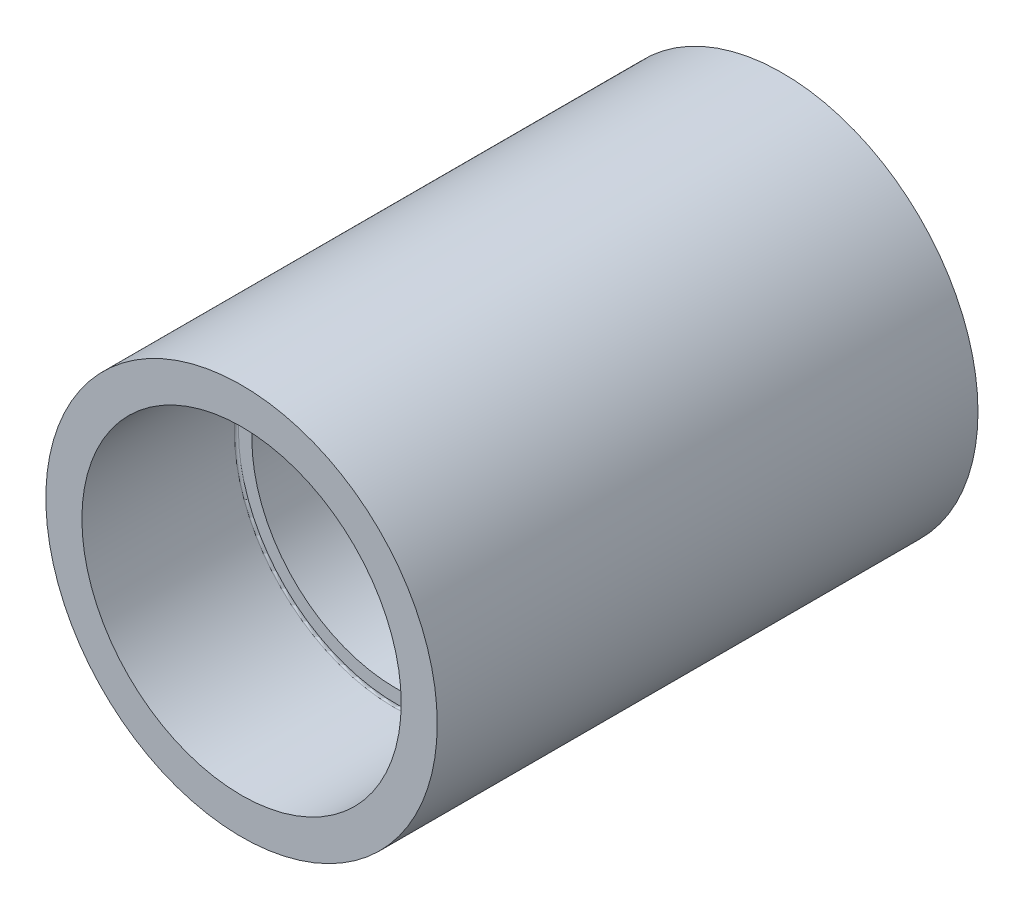
ISO-10303-21;
HEADER;
FILE_DESCRIPTION(('STEP AP214'),'2;1');
FILE_NAME('part.step','',(''),(''),'','','');
FILE_SCHEMA(('AUTOMOTIVE_DESIGN { 1 0 10303 214 1 1 1 1 }'));
ENDSEC;
DATA;
#1=APPLICATION_CONTEXT('core data for automotive mechanical design processes');
#2=APPLICATION_PROTOCOL_DEFINITION('international standard','automotive_design',2000,#1);
#3=PRODUCT_CONTEXT('',#1,'mechanical');
#4=PRODUCT('Part','Part','',(#3));
#5=PRODUCT_RELATED_PRODUCT_CATEGORY('part','',(#4));
#6=PRODUCT_DEFINITION_FORMATION('','',#4);
#7=PRODUCT_DEFINITION_CONTEXT('part definition',#1,'design');
#8=PRODUCT_DEFINITION('design','',#6,#7);
#9=PRODUCT_DEFINITION_SHAPE('','',#8);
#10=(LENGTH_UNIT() NAMED_UNIT(*) SI_UNIT(.MILLI.,.METRE.));
#11=(NAMED_UNIT(*) PLANE_ANGLE_UNIT() SI_UNIT($,.RADIAN.));
#12=(NAMED_UNIT(*) SI_UNIT($,.STERADIAN.) SOLID_ANGLE_UNIT());
#13=UNCERTAINTY_MEASURE_WITH_UNIT(LENGTH_MEASURE(1.E-05),#10,'distance_accuracy_value','');
#14=(GEOMETRIC_REPRESENTATION_CONTEXT(3) GLOBAL_UNCERTAINTY_ASSIGNED_CONTEXT((#13)) GLOBAL_UNIT_ASSIGNED_CONTEXT((#10,
#11,#12)) REPRESENTATION_CONTEXT('',''));
#15=CARTESIAN_POINT('',(0.,0.,0.));
#16=DIRECTION('',(0.,0.,1.));
#17=DIRECTION('',(1.,0.,0.));
#18=AXIS2_PLACEMENT_3D('',#15,#16,#17);
#19=CARTESIAN_POINT('',(0.,31.,52.5));
#20=DIRECTION('',(0.,0.,-1.));
#21=DIRECTION('',(-1.,0.,0.));
#22=AXIS2_PLACEMENT_3D('',#19,#20,#21);
#23=PLANE('',#22);
#24=CARTESIAN_POINT('',(0.,0.,52.5));
#25=DIRECTION('',(0.,0.,1.));
#26=DIRECTION('',(1.,0.,0.));
#27=AXIS2_PLACEMENT_3D('',#24,#25,#26);
#28=CIRCLE('',#27,31.);
#29=CARTESIAN_POINT('',(31.,0.,52.5));
#30=VERTEX_POINT('',#29);
#31=EDGE_CURVE('E67',#30,#30,#28,.T.);
#32=ORIENTED_EDGE('',*,*,#31,.F.);
#33=EDGE_LOOP('',(#32));
#34=FACE_BOUND('',#33,.T.);
#35=CARTESIAN_POINT('',(0.,0.,52.5));
#36=DIRECTION('',(0.,0.,1.));
#37=DIRECTION('',(1.,0.,0.));
#38=AXIS2_PLACEMENT_3D('',#35,#36,#37);
#39=CIRCLE('',#38,38.);
#40=CARTESIAN_POINT('',(38.,0.,52.5));
#41=VERTEX_POINT('',#40);
#42=EDGE_CURVE('E52',#41,#41,#39,.T.);
#43=ORIENTED_EDGE('',*,*,#42,.T.);
#44=EDGE_LOOP('',(#43));
#45=FACE_BOUND('',#44,.T.);
#46=ADVANCED_FACE('F32',(#34,#45),#23,.F.);
#47=CARTESIAN_POINT('',(0.,0.,52.5));
#48=DIRECTION('',(0.,0.,1.));
#49=DIRECTION('',(1.,0.,0.));
#50=AXIS2_PLACEMENT_3D('',#47,#48,#49);
#51=CYLINDRICAL_SURFACE('',#50,38.);
#52=ORIENTED_EDGE('',*,*,#42,.F.);
#53=EDGE_LOOP('',(#52));
#54=FACE_BOUND('',#53,.T.);
#55=CARTESIAN_POINT('',(0.,0.,-52.5));
#56=DIRECTION('',(0.,0.,1.));
#57=DIRECTION('',(1.,0.,0.));
#58=AXIS2_PLACEMENT_3D('',#55,#56,#57);
#59=CIRCLE('',#58,38.);
#60=CARTESIAN_POINT('',(38.,0.,-52.5));
#61=VERTEX_POINT('',#60);
#62=EDGE_CURVE('E55',#61,#61,#59,.T.);
#63=ORIENTED_EDGE('',*,*,#62,.T.);
#64=EDGE_LOOP('',(#63));
#65=FACE_BOUND('',#64,.T.);
#66=ADVANCED_FACE('F75',(#54,#65),#51,.T.);
#67=CARTESIAN_POINT('',(0.,38.,-52.5));
#68=DIRECTION('',(0.,0.,1.));
#69=DIRECTION('',(1.,0.,0.));
#70=AXIS2_PLACEMENT_3D('',#67,#68,#69);
#71=PLANE('',#70);
#72=ORIENTED_EDGE('',*,*,#62,.F.);
#73=EDGE_LOOP('',(#72));
#74=FACE_BOUND('',#73,.T.);
#75=CARTESIAN_POINT('',(0.,0.,-52.5));
#76=DIRECTION('',(0.,0.,1.));
#77=DIRECTION('',(1.,0.,0.));
#78=AXIS2_PLACEMENT_3D('',#75,#76,#77);
#79=CIRCLE('',#78,31.);
#80=CARTESIAN_POINT('',(31.,0.,-52.5));
#81=VERTEX_POINT('',#80);
#82=EDGE_CURVE('E58',#81,#81,#79,.T.);
#83=ORIENTED_EDGE('',*,*,#82,.T.);
#84=EDGE_LOOP('',(#83));
#85=FACE_BOUND('',#84,.T.);
#86=ADVANCED_FACE('F81',(#74,#85),#71,.F.);
#87=CARTESIAN_POINT('',(0.,0.,52.5));
#88=DIRECTION('',(0.,0.,1.));
#89=DIRECTION('',(1.,0.,0.));
#90=AXIS2_PLACEMENT_3D('',#87,#88,#89);
#91=CYLINDRICAL_SURFACE('',#90,31.);
#92=CARTESIAN_POINT('',(0.,0.,-22.9));
#93=DIRECTION('',(0.,0.,1.));
#94=DIRECTION('',(1.,0.,0.));
#95=AXIS2_PLACEMENT_3D('',#92,#93,#94);
#96=CIRCLE('',#95,31.);
#97=CARTESIAN_POINT('',(31.,0.,-22.9));
#98=VERTEX_POINT('',#97);
#99=EDGE_CURVE('E47',#98,#98,#96,.T.);
#100=ORIENTED_EDGE('',*,*,#99,.T.);
#101=EDGE_LOOP('',(#100));
#102=FACE_BOUND('',#101,.T.);
#103=ORIENTED_EDGE('',*,*,#82,.F.);
#104=EDGE_LOOP('',(#103));
#105=FACE_BOUND('',#104,.T.);
#106=ADVANCED_FACE('F87',(#102,#105),#91,.F.);
#107=CARTESIAN_POINT('',(0.,31.,-22.5));
#108=DIRECTION('',(0.,0.,1.));
#109=DIRECTION('',(1.,0.,0.));
#110=AXIS2_PLACEMENT_3D('',#107,#108,#109);
#111=PLANE('',#110);
#112=CARTESIAN_POINT('',(0.,0.,-22.5));
#113=DIRECTION('',(0.,0.,1.));
#114=DIRECTION('',(1.,0.,0.));
#115=AXIS2_PLACEMENT_3D('',#112,#113,#114);
#116=CIRCLE('',#115,30.6);
#117=CARTESIAN_POINT('',(30.6,0.,-22.5));
#118=VERTEX_POINT('',#117);
#119=EDGE_CURVE('E43',#118,#118,#116,.F.);
#120=ORIENTED_EDGE('',*,*,#119,.T.);
#121=EDGE_LOOP('',(#120));
#122=FACE_BOUND('',#121,.T.);
#123=CARTESIAN_POINT('',(0.,0.,-22.5));
#124=DIRECTION('',(0.,0.,1.));
#125=DIRECTION('',(1.,0.,0.));
#126=AXIS2_PLACEMENT_3D('',#123,#124,#125);
#127=CIRCLE('',#126,28.);
#128=CARTESIAN_POINT('',(28.,0.,-22.5));
#129=VERTEX_POINT('',#128);
#130=EDGE_CURVE('E61',#129,#129,#127,.T.);
#131=ORIENTED_EDGE('',*,*,#130,.T.);
#132=EDGE_LOOP('',(#131));
#133=FACE_BOUND('',#132,.T.);
#134=ADVANCED_FACE('F92',(#122,#133),#111,.F.);
#135=CARTESIAN_POINT('',(0.,0.,52.5));
#136=DIRECTION('',(0.,0.,1.));
#137=DIRECTION('',(1.,0.,0.));
#138=AXIS2_PLACEMENT_3D('',#135,#136,#137);
#139=CYLINDRICAL_SURFACE('',#138,28.);
#140=ORIENTED_EDGE('',*,*,#130,.F.);
#141=EDGE_LOOP('',(#140));
#142=FACE_BOUND('',#141,.T.);
#143=CARTESIAN_POINT('',(0.,0.,22.5));
#144=DIRECTION('',(0.,0.,1.));
#145=DIRECTION('',(1.,0.,0.));
#146=AXIS2_PLACEMENT_3D('',#143,#144,#145);
#147=CIRCLE('',#146,28.);
#148=CARTESIAN_POINT('',(28.,0.,22.5));
#149=VERTEX_POINT('',#148);
#150=EDGE_CURVE('E64',#149,#149,#147,.T.);
#151=ORIENTED_EDGE('',*,*,#150,.T.);
#152=EDGE_LOOP('',(#151));
#153=FACE_BOUND('',#152,.T.);
#154=ADVANCED_FACE('F98',(#142,#153),#139,.F.);
#155=CARTESIAN_POINT('',(0.,28.,22.5));
#156=DIRECTION('',(0.,0.,-1.));
#157=DIRECTION('',(-1.,0.,0.));
#158=AXIS2_PLACEMENT_3D('',#155,#156,#157);
#159=PLANE('',#158);
#160=CARTESIAN_POINT('',(0.,0.,22.5));
#161=DIRECTION('',(0.,0.,-1.));
#162=DIRECTION('',(-1.,0.,0.));
#163=AXIS2_PLACEMENT_3D('',#160,#161,#162);
#164=CIRCLE('',#163,30.6);
#165=CARTESIAN_POINT('',(-30.6,0.,22.5));
#166=VERTEX_POINT('',#165);
#167=EDGE_CURVE('E39',#166,#166,#164,.F.);
#168=ORIENTED_EDGE('',*,*,#167,.T.);
#169=EDGE_LOOP('',(#168));
#170=FACE_BOUND('',#169,.T.);
#171=ORIENTED_EDGE('',*,*,#150,.F.);
#172=EDGE_LOOP('',(#171));
#173=FACE_BOUND('',#172,.T.);
#174=ADVANCED_FACE('F110',(#170,#173),#159,.F.);
#175=CARTESIAN_POINT('',(0.,0.,52.5));
#176=DIRECTION('',(0.,0.,1.));
#177=DIRECTION('',(1.,0.,0.));
#178=AXIS2_PLACEMENT_3D('',#175,#176,#177);
#179=CYLINDRICAL_SURFACE('',#178,31.);
#180=CARTESIAN_POINT('',(0.,0.,22.9));
#181=DIRECTION('',(0.,0.,-1.));
#182=DIRECTION('',(-1.,0.,0.));
#183=AXIS2_PLACEMENT_3D('',#180,#181,#182);
#184=CIRCLE('',#183,31.);
#185=CARTESIAN_POINT('',(-31.,0.,22.9));
#186=VERTEX_POINT('',#185);
#187=EDGE_CURVE('E10',#186,#186,#184,.T.);
#188=ORIENTED_EDGE('',*,*,#187,.T.);
#189=EDGE_LOOP('',(#188));
#190=FACE_BOUND('',#189,.T.);
#191=ORIENTED_EDGE('',*,*,#31,.T.);
#192=EDGE_LOOP('',(#191));
#193=FACE_BOUND('',#192,.T.);
#194=ADVANCED_FACE('F71',(#190,#193),#179,.F.);
#195=CARTESIAN_POINT('',(0.,0.,-22.9));
#196=DIRECTION('',(0.,0.,1.));
#197=DIRECTION('',(1.,0.,0.));
#198=AXIS2_PLACEMENT_3D('',#195,#196,#197);
#199=TOROIDAL_SURFACE('',#198,30.6,0.4);
#200=ORIENTED_EDGE('',*,*,#119,.F.);
#201=EDGE_LOOP('',(#200));
#202=FACE_BOUND('',#201,.T.);
#203=ORIENTED_EDGE('',*,*,#99,.F.);
#204=EDGE_LOOP('',(#203));
#205=FACE_BOUND('',#204,.T.);
#206=ADVANCED_FACE('F102',(#202,#205),#199,.F.);
#207=CARTESIAN_POINT('',(0.,0.,22.9));
#208=DIRECTION('',(0.,0.,-1.));
#209=DIRECTION('',(-1.,0.,0.));
#210=AXIS2_PLACEMENT_3D('',#207,#208,#209);
#211=TOROIDAL_SURFACE('',#210,30.6,0.4);
#212=ORIENTED_EDGE('',*,*,#187,.F.);
#213=EDGE_LOOP('',(#212));
#214=FACE_BOUND('',#213,.T.);
#215=ORIENTED_EDGE('',*,*,#167,.F.);
#216=EDGE_LOOP('',(#215));
#217=FACE_BOUND('',#216,.T.);
#218=ADVANCED_FACE('F34',(#214,#217),#211,.F.);
#219=CLOSED_SHELL('',(#46,#66,#86,#106,#134,#154,#174,#194,#206,#218));
#220=MANIFOLD_SOLID_BREP('B2',#219);
#221=ADVANCED_BREP_SHAPE_REPRESENTATION('',(#18,#220),#14);
#222=SHAPE_DEFINITION_REPRESENTATION(#9,#221);
ENDSEC;
END-ISO-10303-21;
